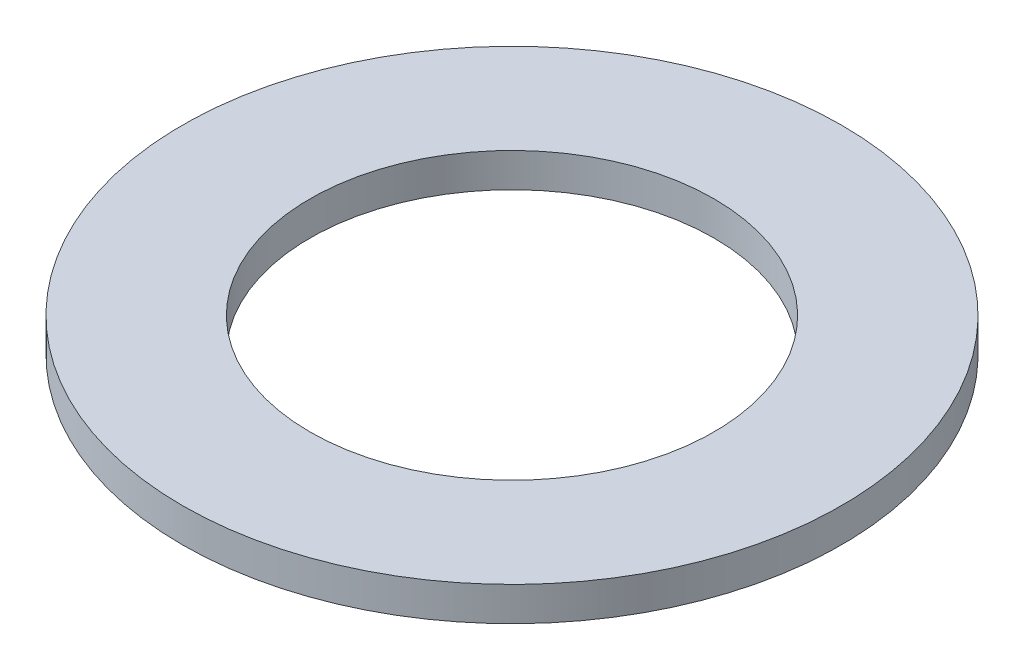
ISO-10303-21;
HEADER;
FILE_DESCRIPTION(('STEP AP214'),'2;1');
FILE_NAME('part.step','',(''),(''),'','','');
FILE_SCHEMA(('AUTOMOTIVE_DESIGN { 1 0 10303 214 1 1 1 1 }'));
ENDSEC;
DATA;
#1=APPLICATION_CONTEXT('core data for automotive mechanical design processes');
#2=APPLICATION_PROTOCOL_DEFINITION('international standard','automotive_design',2000,#1);
#3=PRODUCT_CONTEXT('',#1,'mechanical');
#4=PRODUCT('Part','Part','',(#3));
#5=PRODUCT_RELATED_PRODUCT_CATEGORY('part','',(#4));
#6=PRODUCT_DEFINITION_FORMATION('','',#4);
#7=PRODUCT_DEFINITION_CONTEXT('part definition',#1,'design');
#8=PRODUCT_DEFINITION('design','',#6,#7);
#9=PRODUCT_DEFINITION_SHAPE('','',#8);
#10=(LENGTH_UNIT() NAMED_UNIT(*) SI_UNIT(.MILLI.,.METRE.));
#11=(NAMED_UNIT(*) PLANE_ANGLE_UNIT() SI_UNIT($,.RADIAN.));
#12=(NAMED_UNIT(*) SI_UNIT($,.STERADIAN.) SOLID_ANGLE_UNIT());
#13=UNCERTAINTY_MEASURE_WITH_UNIT(LENGTH_MEASURE(1.E-05),#10,'distance_accuracy_value','');
#14=(GEOMETRIC_REPRESENTATION_CONTEXT(3) GLOBAL_UNCERTAINTY_ASSIGNED_CONTEXT((#13)) GLOBAL_UNIT_ASSIGNED_CONTEXT((#10,
#11,#12)) REPRESENTATION_CONTEXT('',''));
#15=CARTESIAN_POINT('',(0.,0.,0.));
#16=DIRECTION('',(0.,0.,1.));
#17=DIRECTION('',(1.,0.,0.));
#18=AXIS2_PLACEMENT_3D('',#15,#16,#17);
#19=CARTESIAN_POINT('',(0.,8.,0.));
#20=DIRECTION('',(0.,-1.,0.));
#21=DIRECTION('',(0.,0.,-1.));
#22=AXIS2_PLACEMENT_3D('',#19,#20,#21);
#23=CYLINDRICAL_SURFACE('',#22,77.5);
#24=CARTESIAN_POINT('',(0.,8.,0.));
#25=DIRECTION('',(0.,1.,0.));
#26=DIRECTION('',(0.,0.,1.));
#27=AXIS2_PLACEMENT_3D('',#24,#25,#26);
#28=CIRCLE('',#27,77.5);
#29=CARTESIAN_POINT('',(0.,8.,77.5));
#30=VERTEX_POINT('',#29);
#31=EDGE_CURVE('E10',#30,#30,#28,.T.);
#32=ORIENTED_EDGE('',*,*,#31,.F.);
#33=EDGE_LOOP('',(#32));
#34=FACE_BOUND('',#33,.T.);
#35=CARTESIAN_POINT('',(0.,0.,0.));
#36=DIRECTION('',(0.,1.,0.));
#37=DIRECTION('',(0.,0.,1.));
#38=AXIS2_PLACEMENT_3D('',#35,#36,#37);
#39=CIRCLE('',#38,77.5);
#40=CARTESIAN_POINT('',(0.,0.,77.5));
#41=VERTEX_POINT('',#40);
#42=EDGE_CURVE('E37',#41,#41,#39,.T.);
#43=ORIENTED_EDGE('',*,*,#42,.T.);
#44=EDGE_LOOP('',(#43));
#45=FACE_BOUND('',#44,.T.);
#46=ADVANCED_FACE('F40',(#34,#45),#23,.T.);
#47=CARTESIAN_POINT('',(0.,8.,0.));
#48=DIRECTION('',(0.,1.,0.));
#49=DIRECTION('',(0.,0.,1.));
#50=AXIS2_PLACEMENT_3D('',#47,#48,#49);
#51=PLANE('',#50);
#52=CARTESIAN_POINT('',(0.,8.,0.));
#53=DIRECTION('',(0.,1.,0.));
#54=DIRECTION('',(0.,0.,1.));
#55=AXIS2_PLACEMENT_3D('',#52,#53,#54);
#56=CIRCLE('',#55,47.5);
#57=CARTESIAN_POINT('',(0.,8.,47.5));
#58=VERTEX_POINT('',#57);
#59=EDGE_CURVE('E50',#58,#58,#56,.T.);
#60=ORIENTED_EDGE('',*,*,#59,.F.);
#61=EDGE_LOOP('',(#60));
#62=FACE_BOUND('',#61,.T.);
#63=ORIENTED_EDGE('',*,*,#31,.T.);
#64=EDGE_LOOP('',(#63));
#65=FACE_BOUND('',#64,.T.);
#66=ADVANCED_FACE('F59',(#62,#65),#51,.T.);
#67=CARTESIAN_POINT('',(0.,0.,0.));
#68=DIRECTION('',(0.,1.,0.));
#69=DIRECTION('',(0.,0.,1.));
#70=AXIS2_PLACEMENT_3D('',#67,#68,#69);
#71=PLANE('',#70);
#72=CARTESIAN_POINT('',(0.,0.,0.));
#73=DIRECTION('',(0.,1.,0.));
#74=DIRECTION('',(0.,0.,1.));
#75=AXIS2_PLACEMENT_3D('',#72,#73,#74);
#76=CIRCLE('',#75,47.5);
#77=CARTESIAN_POINT('',(0.,0.,47.5));
#78=VERTEX_POINT('',#77);
#79=EDGE_CURVE('E47',#78,#78,#76,.T.);
#80=ORIENTED_EDGE('',*,*,#79,.T.);
#81=EDGE_LOOP('',(#80));
#82=FACE_BOUND('',#81,.T.);
#83=ORIENTED_EDGE('',*,*,#42,.F.);
#84=EDGE_LOOP('',(#83));
#85=FACE_BOUND('',#84,.T.);
#86=ADVANCED_FACE('F58',(#82,#85),#71,.F.);
#87=CARTESIAN_POINT('',(0.,8.,0.));
#88=DIRECTION('',(0.,-1.,0.));
#89=DIRECTION('',(0.,0.,-1.));
#90=AXIS2_PLACEMENT_3D('',#87,#88,#89);
#91=CYLINDRICAL_SURFACE('',#90,47.5);
#92=ORIENTED_EDGE('',*,*,#59,.T.);
#93=EDGE_LOOP('',(#92));
#94=FACE_BOUND('',#93,.T.);
#95=ORIENTED_EDGE('',*,*,#79,.F.);
#96=EDGE_LOOP('',(#95));
#97=FACE_BOUND('',#96,.T.);
#98=ADVANCED_FACE('F54',(#94,#97),#91,.F.);
#99=CLOSED_SHELL('',(#46,#66,#86,#98));
#100=MANIFOLD_SOLID_BREP('B2',#99);
#101=ADVANCED_BREP_SHAPE_REPRESENTATION('',(#18,#100),#14);
#102=SHAPE_DEFINITION_REPRESENTATION(#9,#101);
ENDSEC;
END-ISO-10303-21;
